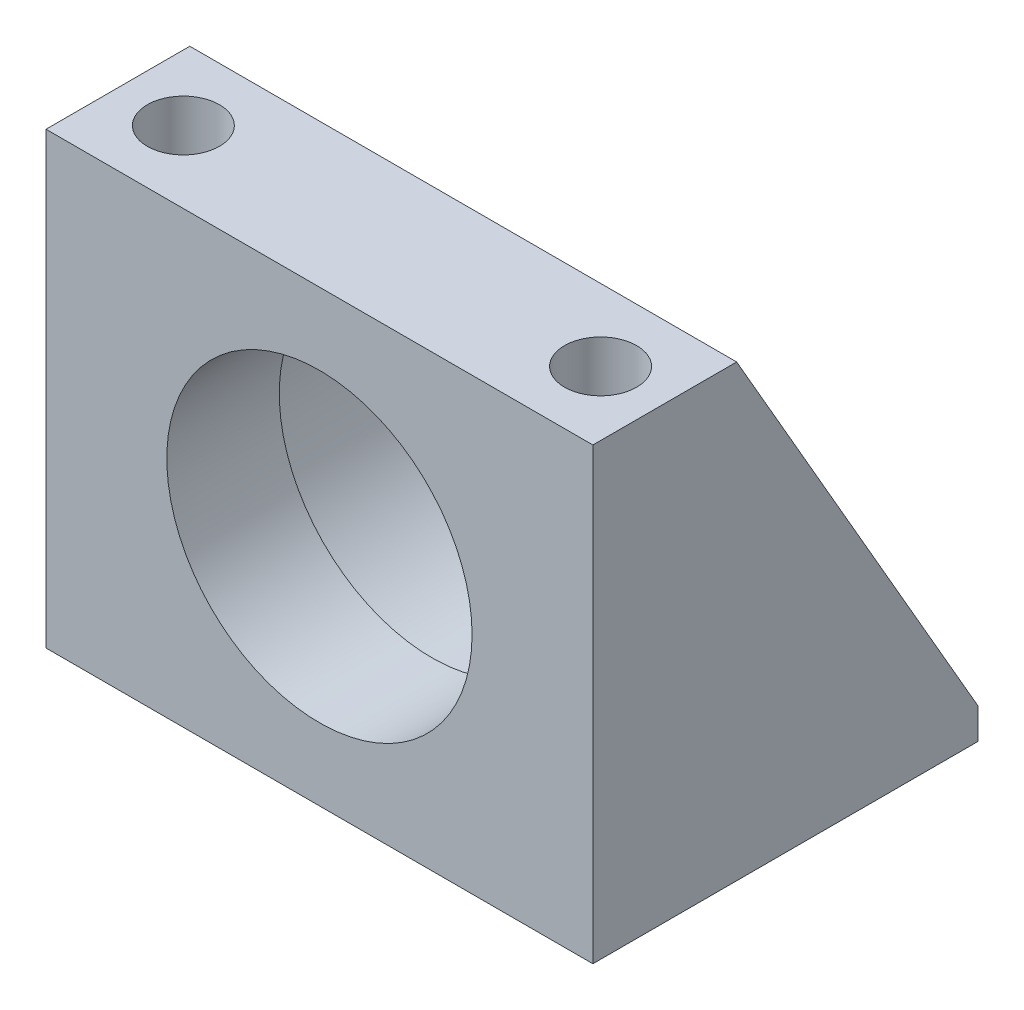
ISO-10303-21;
HEADER;
FILE_DESCRIPTION(('STEP AP214'),'2;1');
FILE_NAME('part.step','',(''),(''),'','','');
FILE_SCHEMA(('AUTOMOTIVE_DESIGN { 1 0 10303 214 1 1 1 1 }'));
ENDSEC;
DATA;
#1=APPLICATION_CONTEXT('core data for automotive mechanical design processes');
#2=APPLICATION_PROTOCOL_DEFINITION('international standard','automotive_design',2000,#1);
#3=PRODUCT_CONTEXT('',#1,'mechanical');
#4=PRODUCT('Part','Part','',(#3));
#5=PRODUCT_RELATED_PRODUCT_CATEGORY('part','',(#4));
#6=PRODUCT_DEFINITION_FORMATION('','',#4);
#7=PRODUCT_DEFINITION_CONTEXT('part definition',#1,'design');
#8=PRODUCT_DEFINITION('design','',#6,#7);
#9=PRODUCT_DEFINITION_SHAPE('','',#8);
#10=(LENGTH_UNIT() NAMED_UNIT(*) SI_UNIT(.MILLI.,.METRE.));
#11=(NAMED_UNIT(*) PLANE_ANGLE_UNIT() SI_UNIT($,.RADIAN.));
#12=(NAMED_UNIT(*) SI_UNIT($,.STERADIAN.) SOLID_ANGLE_UNIT());
#13=UNCERTAINTY_MEASURE_WITH_UNIT(LENGTH_MEASURE(1.E-05),#10,'distance_accuracy_value','');
#14=(GEOMETRIC_REPRESENTATION_CONTEXT(3) GLOBAL_UNCERTAINTY_ASSIGNED_CONTEXT((#13)) GLOBAL_UNIT_ASSIGNED_CONTEXT((#10,
#11,#12)) REPRESENTATION_CONTEXT('',''));
#15=CARTESIAN_POINT('',(0.,0.,0.));
#16=DIRECTION('',(0.,0.,1.));
#17=DIRECTION('',(1.,0.,0.));
#18=AXIS2_PLACEMENT_3D('',#15,#16,#17);
#19=CARTESIAN_POINT('',(-27.051,44.45,-38.1));
#20=DIRECTION('',(-1.,0.,0.));
#21=DIRECTION('',(0.,-1.,0.));
#22=AXIS2_PLACEMENT_3D('',#19,#20,#21);
#23=PLANE('',#22);
#24=DIRECTION('',(0.,-0.866274050242107,-0.4995690841887));
#25=VECTOR('',#24,1.);
#26=CARTESIAN_POINT('',(-27.051,44.45,-14.224));
#27=LINE('',#26,#25);
#28=CARTESIAN_POINT('',(-27.051,44.45,-14.224));
#29=VERTEX_POINT('',#28);
#30=CARTESIAN_POINT('',(-27.051,3.04800000000001,-38.1));
#31=VERTEX_POINT('',#30);
#32=EDGE_CURVE('E191',#29,#31,#27,.T.);
#33=ORIENTED_EDGE('',*,*,#32,.T.);
#34=DIRECTION('',(0.,-1.,0.));
#35=VECTOR('',#34,1.);
#36=CARTESIAN_POINT('',(-27.051,44.45,-38.1));
#37=LINE('',#36,#35);
#38=CARTESIAN_POINT('',(-27.051,0.,-38.1));
#39=VERTEX_POINT('',#38);
#40=EDGE_CURVE('E104',#31,#39,#37,.T.);
#41=ORIENTED_EDGE('',*,*,#40,.T.);
#42=DIRECTION('',(0.,0.,1.));
#43=VECTOR('',#42,1.);
#44=CARTESIAN_POINT('',(-27.051,0.,-38.1));
#45=LINE('',#44,#43);
#46=CARTESIAN_POINT('',(-27.051,0.,0.));
#47=VERTEX_POINT('',#46);
#48=EDGE_CURVE('E94',#39,#47,#45,.T.);
#49=ORIENTED_EDGE('',*,*,#48,.T.);
#50=DIRECTION('',(0.,-1.,0.));
#51=VECTOR('',#50,1.);
#52=CARTESIAN_POINT('',(-27.051,44.45,0.));
#53=LINE('',#52,#51);
#54=CARTESIAN_POINT('',(-27.051,44.45,0.));
#55=VERTEX_POINT('',#54);
#56=EDGE_CURVE('E92',#55,#47,#53,.T.);
#57=ORIENTED_EDGE('',*,*,#56,.F.);
#58=DIRECTION('',(0.,0.,1.));
#59=VECTOR('',#58,1.);
#60=CARTESIAN_POINT('',(-27.051,44.45,-38.1));
#61=LINE('',#60,#59);
#62=EDGE_CURVE('E79',#29,#55,#61,.T.);
#63=ORIENTED_EDGE('',*,*,#62,.F.);
#64=EDGE_LOOP('',(#33,#41,#49,#57,#63));
#65=FACE_BOUND('',#64,.T.);
#66=ADVANCED_FACE('F35',(#65),#23,.T.);
#67=CARTESIAN_POINT('',(-27.051,44.45,-38.1));
#68=DIRECTION('',(0.,1.,0.));
#69=DIRECTION('',(0.,0.,1.));
#70=AXIS2_PLACEMENT_3D('',#67,#68,#69);
#71=PLANE('',#70);
#72=CARTESIAN_POINT('',(-20.574,44.45,-7.112));
#73=DIRECTION('',(0.,1.,0.));
#74=DIRECTION('',(0.,0.,1.));
#75=AXIS2_PLACEMENT_3D('',#72,#73,#74);
#76=CIRCLE('',#75,3.56870000000001);
#77=CARTESIAN_POINT('',(-20.574,44.45,-3.54329999999999));
#78=VERTEX_POINT('',#77);
#79=EDGE_CURVE('E179',#78,#78,#76,.T.);
#80=ORIENTED_EDGE('',*,*,#79,.F.);
#81=EDGE_LOOP('',(#80));
#82=FACE_BOUND('',#81,.T.);
#83=CARTESIAN_POINT('',(20.701,44.45,-7.112));
#84=DIRECTION('',(0.,1.,0.));
#85=DIRECTION('',(0.,0.,1.));
#86=AXIS2_PLACEMENT_3D('',#83,#84,#85);
#87=CIRCLE('',#86,3.56870000000001);
#88=CARTESIAN_POINT('',(20.701,44.45,-3.54329999999999));
#89=VERTEX_POINT('',#88);
#90=EDGE_CURVE('E183',#89,#89,#87,.T.);
#91=ORIENTED_EDGE('',*,*,#90,.F.);
#92=EDGE_LOOP('',(#91));
#93=FACE_BOUND('',#92,.T.);
#94=DIRECTION('',(1.,0.,0.));
#95=VECTOR('',#94,1.);
#96=CARTESIAN_POINT('',(-27.051,44.45,-14.224));
#97=LINE('',#96,#95);
#98=CARTESIAN_POINT('',(27.051,44.45,-14.224));
#99=VERTEX_POINT('',#98);
#100=EDGE_CURVE('E86',#29,#99,#97,.T.);
#101=ORIENTED_EDGE('',*,*,#100,.F.);
#102=ORIENTED_EDGE('',*,*,#62,.T.);
#103=DIRECTION('',(-1.,0.,0.));
#104=VECTOR('',#103,1.);
#105=CARTESIAN_POINT('',(-27.051,44.45,0.));
#106=LINE('',#105,#104);
#107=CARTESIAN_POINT('',(27.051,44.45,0.));
#108=VERTEX_POINT('',#107);
#109=EDGE_CURVE('E84',#108,#55,#106,.T.);
#110=ORIENTED_EDGE('',*,*,#109,.F.);
#111=DIRECTION('',(0.,0.,1.));
#112=VECTOR('',#111,1.);
#113=CARTESIAN_POINT('',(27.051,44.45,-38.1));
#114=LINE('',#113,#112);
#115=EDGE_CURVE('E89',#99,#108,#114,.T.);
#116=ORIENTED_EDGE('',*,*,#115,.F.);
#117=EDGE_LOOP('',(#101,#102,#110,#116));
#118=FACE_BOUND('',#117,.T.);
#119=ADVANCED_FACE('F81',(#82,#93,#118),#71,.T.);
#120=CARTESIAN_POINT('',(27.051,44.45,-38.1));
#121=DIRECTION('',(1.,0.,0.));
#122=DIRECTION('',(0.,1.,0.));
#123=AXIS2_PLACEMENT_3D('',#120,#121,#122);
#124=PLANE('',#123);
#125=DIRECTION('',(0.,-0.866274050242107,-0.4995690841887));
#126=VECTOR('',#125,1.);
#127=CARTESIAN_POINT('',(27.051,44.45,-14.224));
#128=LINE('',#127,#126);
#129=CARTESIAN_POINT('',(27.051,3.048,-38.1));
#130=VERTEX_POINT('',#129);
#131=EDGE_CURVE('E50',#99,#130,#128,.T.);
#132=ORIENTED_EDGE('',*,*,#131,.F.);
#133=ORIENTED_EDGE('',*,*,#115,.T.);
#134=DIRECTION('',(0.,1.,0.));
#135=VECTOR('',#134,1.);
#136=CARTESIAN_POINT('',(27.051,44.45,0.));
#137=LINE('',#136,#135);
#138=CARTESIAN_POINT('',(27.051,0.,0.));
#139=VERTEX_POINT('',#138);
#140=EDGE_CURVE('E103',#139,#108,#137,.T.);
#141=ORIENTED_EDGE('',*,*,#140,.F.);
#142=DIRECTION('',(0.,0.,1.));
#143=VECTOR('',#142,1.);
#144=CARTESIAN_POINT('',(27.051,0.,-38.1));
#145=LINE('',#144,#143);
#146=CARTESIAN_POINT('',(27.051,0.,-38.1));
#147=VERTEX_POINT('',#146);
#148=EDGE_CURVE('E59',#147,#139,#145,.T.);
#149=ORIENTED_EDGE('',*,*,#148,.F.);
#150=DIRECTION('',(0.,1.,0.));
#151=VECTOR('',#150,1.);
#152=CARTESIAN_POINT('',(27.051,44.45,-38.1));
#153=LINE('',#152,#151);
#154=EDGE_CURVE('E114',#147,#130,#153,.T.);
#155=ORIENTED_EDGE('',*,*,#154,.T.);
#156=EDGE_LOOP('',(#132,#133,#141,#149,#155));
#157=FACE_BOUND('',#156,.T.);
#158=ADVANCED_FACE('F145',(#157),#124,.T.);
#159=CARTESIAN_POINT('',(-27.051,0.,-38.1));
#160=DIRECTION('',(0.,-1.,0.));
#161=DIRECTION('',(0.,0.,-1.));
#162=AXIS2_PLACEMENT_3D('',#159,#160,#161);
#163=PLANE('',#162);
#164=CARTESIAN_POINT('',(-20.574,0.,-7.112));
#165=DIRECTION('',(0.,-1.,0.));
#166=DIRECTION('',(0.,0.,-1.));
#167=AXIS2_PLACEMENT_3D('',#164,#165,#166);
#168=CIRCLE('',#167,3.56870000000001);
#169=CARTESIAN_POINT('',(-20.574,0.,-10.6807));
#170=VERTEX_POINT('',#169);
#171=EDGE_CURVE('E182',#170,#170,#168,.T.);
#172=ORIENTED_EDGE('',*,*,#171,.F.);
#173=EDGE_LOOP('',(#172));
#174=FACE_BOUND('',#173,.T.);
#175=CARTESIAN_POINT('',(20.701,0.,-7.112));
#176=DIRECTION('',(0.,-1.,0.));
#177=DIRECTION('',(0.,0.,-1.));
#178=AXIS2_PLACEMENT_3D('',#175,#176,#177);
#179=CIRCLE('',#178,3.56870000000001);
#180=CARTESIAN_POINT('',(20.701,0.,-10.6807));
#181=VERTEX_POINT('',#180);
#182=EDGE_CURVE('E119',#181,#181,#179,.T.);
#183=ORIENTED_EDGE('',*,*,#182,.F.);
#184=EDGE_LOOP('',(#183));
#185=FACE_BOUND('',#184,.T.);
#186=DIRECTION('',(1.,0.,0.));
#187=VECTOR('',#186,1.);
#188=CARTESIAN_POINT('',(-27.051,0.,0.));
#189=LINE('',#188,#187);
#190=EDGE_CURVE('E98',#47,#139,#189,.T.);
#191=ORIENTED_EDGE('',*,*,#190,.F.);
#192=ORIENTED_EDGE('',*,*,#48,.F.);
#193=DIRECTION('',(1.,0.,0.));
#194=VECTOR('',#193,1.);
#195=CARTESIAN_POINT('',(-27.051,0.,-38.1));
#196=LINE('',#195,#194);
#197=EDGE_CURVE('E106',#39,#147,#196,.T.);
#198=ORIENTED_EDGE('',*,*,#197,.T.);
#199=ORIENTED_EDGE('',*,*,#148,.T.);
#200=EDGE_LOOP('',(#191,#192,#198,#199));
#201=FACE_BOUND('',#200,.T.);
#202=ADVANCED_FACE('F149',(#174,#185,#201),#163,.T.);
#203=CARTESIAN_POINT('',(-27.051,0.,-38.1));
#204=DIRECTION('',(0.,0.,1.));
#205=DIRECTION('',(1.,0.,0.));
#206=AXIS2_PLACEMENT_3D('',#203,#204,#205);
#207=PLANE('',#206);
#208=ORIENTED_EDGE('',*,*,#40,.F.);
#209=DIRECTION('',(1.,0.,0.));
#210=VECTOR('',#209,1.);
#211=CARTESIAN_POINT('',(-27.051,3.04800000000001,-38.1));
#212=LINE('',#211,#210);
#213=EDGE_CURVE('E194',#31,#130,#212,.T.);
#214=ORIENTED_EDGE('',*,*,#213,.T.);
#215=ORIENTED_EDGE('',*,*,#154,.F.);
#216=ORIENTED_EDGE('',*,*,#197,.F.);
#217=EDGE_LOOP('',(#208,#214,#215,#216));
#218=FACE_BOUND('',#217,.T.);
#219=ADVANCED_FACE('F152',(#218),#207,.F.);
#220=CARTESIAN_POINT('',(-27.051,0.,0.));
#221=DIRECTION('',(0.,0.,1.));
#222=DIRECTION('',(1.,0.,0.));
#223=AXIS2_PLACEMENT_3D('',#220,#221,#222);
#224=PLANE('',#223);
#225=CARTESIAN_POINT('',(0.,22.225,0.));
#226=DIRECTION('',(0.,0.,1.));
#227=DIRECTION('',(1.,0.,0.));
#228=AXIS2_PLACEMENT_3D('',#225,#226,#227);
#229=CIRCLE('',#228,15.1003);
#230=CARTESIAN_POINT('',(15.1003,22.225,0.));
#231=VERTEX_POINT('',#230);
#232=EDGE_CURVE('E99',#231,#231,#229,.T.);
#233=ORIENTED_EDGE('',*,*,#232,.F.);
#234=EDGE_LOOP('',(#233));
#235=FACE_BOUND('',#234,.T.);
#236=ORIENTED_EDGE('',*,*,#56,.T.);
#237=ORIENTED_EDGE('',*,*,#190,.T.);
#238=ORIENTED_EDGE('',*,*,#140,.T.);
#239=ORIENTED_EDGE('',*,*,#109,.T.);
#240=EDGE_LOOP('',(#236,#237,#238,#239));
#241=FACE_BOUND('',#240,.T.);
#242=ADVANCED_FACE('F102',(#235,#241),#224,.T.);
#243=CARTESIAN_POINT('',(0.,22.225,-38.1));
#244=DIRECTION('',(0.,0.,1.));
#245=DIRECTION('',(1.,0.,0.));
#246=AXIS2_PLACEMENT_3D('',#243,#244,#245);
#247=CYLINDRICAL_SURFACE('',#246,15.1003);
#248=CARTESIAN_POINT('',(0.,22.225,-11.1252));
#249=DIRECTION('',(0.,0.,1.));
#250=DIRECTION('',(1.,0.,0.));
#251=AXIS2_PLACEMENT_3D('',#248,#249,#250);
#252=CIRCLE('',#251,15.1003);
#253=CARTESIAN_POINT('',(15.1003,22.225,-11.1252));
#254=VERTEX_POINT('',#253);
#255=EDGE_CURVE('E118',#254,#254,#252,.F.);
#256=ORIENTED_EDGE('',*,*,#255,.T.);
#257=EDGE_LOOP('',(#256));
#258=FACE_BOUND('',#257,.T.);
#259=ORIENTED_EDGE('',*,*,#232,.T.);
#260=EDGE_LOOP('',(#259));
#261=FACE_BOUND('',#260,.T.);
#262=ADVANCED_FACE('F158',(#258,#261),#247,.F.);
#263=CARTESIAN_POINT('',(-27.051,44.45,-14.224));
#264=DIRECTION('',(0.,-0.4995690841887,0.866274050242107));
#265=DIRECTION('',(0.,-0.866274050242107,-0.4995690841887));
#266=AXIS2_PLACEMENT_3D('',#263,#264,#265);
#267=PLANE('',#266);
#268=CARTESIAN_POINT('',(0.,22.225,-27.0408711656442));
#269=DIRECTION('',(0.,-0.4995690841887,0.866274050242107));
#270=DIRECTION('',(0.,-0.866274050242107,-0.4995690841887));
#271=AXIS2_PLACEMENT_3D('',#268,#269,#270);
#272=ELLIPSE('',#271,20.2314729329614,17.526);
#273=CARTESIAN_POINT('',(0.,4.699,-37.1478895705521));
#274=VERTEX_POINT('',#273);
#275=EDGE_CURVE('E115',#274,#274,#272,.T.);
#276=ORIENTED_EDGE('',*,*,#275,.T.);
#277=EDGE_LOOP('',(#276));
#278=FACE_BOUND('',#277,.T.);
#279=ORIENTED_EDGE('',*,*,#131,.T.);
#280=ORIENTED_EDGE('',*,*,#213,.F.);
#281=ORIENTED_EDGE('',*,*,#32,.F.);
#282=ORIENTED_EDGE('',*,*,#100,.T.);
#283=EDGE_LOOP('',(#279,#280,#281,#282));
#284=FACE_BOUND('',#283,.T.);
#285=ADVANCED_FACE('F165',(#278,#284),#267,.F.);
#286=CARTESIAN_POINT('',(-27.051,0.,-11.1252));
#287=DIRECTION('',(0.,0.,1.));
#288=DIRECTION('',(1.,0.,0.));
#289=AXIS2_PLACEMENT_3D('',#286,#287,#288);
#290=PLANE('',#289);
#291=CARTESIAN_POINT('',(0.,22.225,-11.1252));
#292=DIRECTION('',(0.,0.,1.));
#293=DIRECTION('',(1.,0.,0.));
#294=AXIS2_PLACEMENT_3D('',#291,#292,#293);
#295=CIRCLE('',#294,16.002);
#296=CARTESIAN_POINT('',(16.002,22.225,-11.1252));
#297=VERTEX_POINT('',#296);
#298=EDGE_CURVE('E43',#297,#297,#295,.F.);
#299=ORIENTED_EDGE('',*,*,#298,.T.);
#300=EDGE_LOOP('',(#299));
#301=FACE_BOUND('',#300,.T.);
#302=ORIENTED_EDGE('',*,*,#255,.F.);
#303=EDGE_LOOP('',(#302));
#304=FACE_BOUND('',#303,.T.);
#305=ADVANCED_FACE('F124',(#301,#304),#290,.F.);
#306=CARTESIAN_POINT('',(0.,22.225,49.5710137883017));
#307=DIRECTION('',(0.,0.,-1.));
#308=DIRECTION('',(-1.,0.,0.));
#309=AXIS2_PLACEMENT_3D('',#306,#307,#308);
#310=CYLINDRICAL_SURFACE('',#309,17.526);
#311=CARTESIAN_POINT('',(0.,22.225,-12.6492));
#312=DIRECTION('',(0.,0.,1.));
#313=DIRECTION('',(1.,0.,0.));
#314=AXIS2_PLACEMENT_3D('',#311,#312,#313);
#315=CIRCLE('',#314,17.526);
#316=CARTESIAN_POINT('',(17.526,22.225,-12.6492));
#317=VERTEX_POINT('',#316);
#318=EDGE_CURVE('E12',#317,#317,#315,.T.);
#319=ORIENTED_EDGE('',*,*,#318,.T.);
#320=EDGE_LOOP('',(#319));
#321=FACE_BOUND('',#320,.T.);
#322=ORIENTED_EDGE('',*,*,#275,.F.);
#323=EDGE_LOOP('',(#322));
#324=FACE_BOUND('',#323,.T.);
#325=ADVANCED_FACE('F129',(#321,#324),#310,.F.);
#326=CARTESIAN_POINT('',(0.,22.225,-12.6492));
#327=DIRECTION('',(0.,0.,1.));
#328=DIRECTION('',(1.,0.,0.));
#329=AXIS2_PLACEMENT_3D('',#326,#327,#328);
#330=TOROIDAL_SURFACE('',#329,16.002,1.524);
#331=ORIENTED_EDGE('',*,*,#318,.F.);
#332=EDGE_LOOP('',(#331));
#333=FACE_BOUND('',#332,.T.);
#334=ORIENTED_EDGE('',*,*,#298,.F.);
#335=EDGE_LOOP('',(#334));
#336=FACE_BOUND('',#335,.T.);
#337=ADVANCED_FACE('F37',(#333,#336),#330,.F.);
#338=CARTESIAN_POINT('',(20.701,44.45,-7.112));
#339=DIRECTION('',(0.,1.,0.));
#340=DIRECTION('',(0.,0.,1.));
#341=AXIS2_PLACEMENT_3D('',#338,#339,#340);
#342=CYLINDRICAL_SURFACE('',#341,3.56870000000001);
#343=ORIENTED_EDGE('',*,*,#90,.T.);
#344=EDGE_LOOP('',(#343));
#345=FACE_BOUND('',#344,.T.);
#346=ORIENTED_EDGE('',*,*,#182,.T.);
#347=EDGE_LOOP('',(#346));
#348=FACE_BOUND('',#347,.T.);
#349=ADVANCED_FACE('F128',(#345,#348),#342,.F.);
#350=CARTESIAN_POINT('',(-20.574,44.45,-7.112));
#351=DIRECTION('',(0.,1.,0.));
#352=DIRECTION('',(0.,0.,1.));
#353=AXIS2_PLACEMENT_3D('',#350,#351,#352);
#354=CYLINDRICAL_SURFACE('',#353,3.56870000000001);
#355=ORIENTED_EDGE('',*,*,#79,.T.);
#356=EDGE_LOOP('',(#355));
#357=FACE_BOUND('',#356,.T.);
#358=ORIENTED_EDGE('',*,*,#171,.T.);
#359=EDGE_LOOP('',(#358));
#360=FACE_BOUND('',#359,.T.);
#361=ADVANCED_FACE('F135',(#357,#360),#354,.F.);
#362=CLOSED_SHELL('',(#66,#119,#158,#202,#219,#242,#262,#285,#305,#325,#337,#349,#361));
#363=MANIFOLD_SOLID_BREP('B2',#362);
#364=ADVANCED_BREP_SHAPE_REPRESENTATION('',(#18,#363),#14);
#365=SHAPE_DEFINITION_REPRESENTATION(#9,#364);
ENDSEC;
END-ISO-10303-21;
